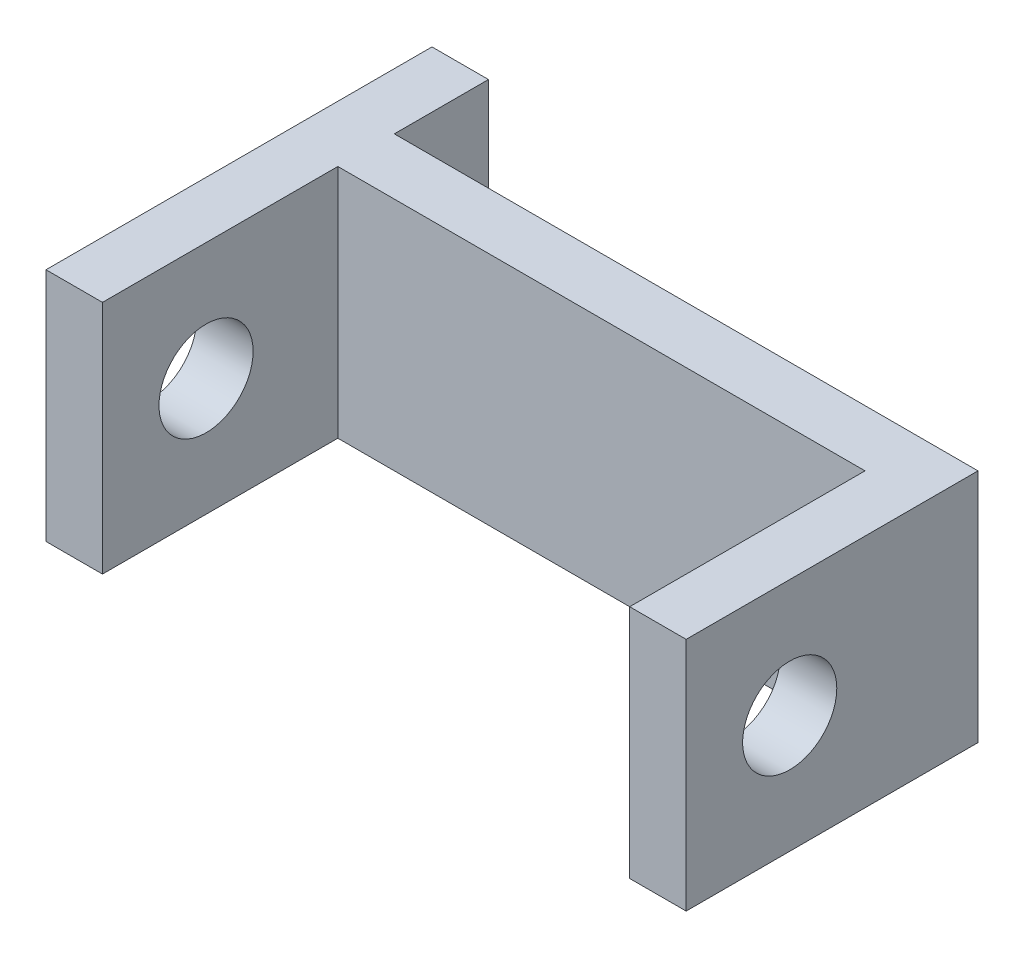
ISO-10303-21;
HEADER;
FILE_DESCRIPTION(('STEP AP214'),'2;1');
FILE_NAME('part.step','',(''),(''),'','','');
FILE_SCHEMA(('AUTOMOTIVE_DESIGN { 1 0 10303 214 1 1 1 1 }'));
ENDSEC;
DATA;
#1=APPLICATION_CONTEXT('core data for automotive mechanical design processes');
#2=APPLICATION_PROTOCOL_DEFINITION('international standard','automotive_design',2000,#1);
#3=PRODUCT_CONTEXT('',#1,'mechanical');
#4=PRODUCT('Part','Part','',(#3));
#5=PRODUCT_RELATED_PRODUCT_CATEGORY('part','',(#4));
#6=PRODUCT_DEFINITION_FORMATION('','',#4);
#7=PRODUCT_DEFINITION_CONTEXT('part definition',#1,'design');
#8=PRODUCT_DEFINITION('design','',#6,#7);
#9=PRODUCT_DEFINITION_SHAPE('','',#8);
#10=(LENGTH_UNIT() NAMED_UNIT(*) SI_UNIT(.MILLI.,.METRE.));
#11=(NAMED_UNIT(*) PLANE_ANGLE_UNIT() SI_UNIT($,.RADIAN.));
#12=(NAMED_UNIT(*) SI_UNIT($,.STERADIAN.) SOLID_ANGLE_UNIT());
#13=UNCERTAINTY_MEASURE_WITH_UNIT(LENGTH_MEASURE(1.E-05),#10,'distance_accuracy_value','');
#14=(GEOMETRIC_REPRESENTATION_CONTEXT(3) GLOBAL_UNCERTAINTY_ASSIGNED_CONTEXT((#13)) GLOBAL_UNIT_ASSIGNED_CONTEXT((#10,
#11,#12)) REPRESENTATION_CONTEXT('',''));
#15=CARTESIAN_POINT('',(0.,0.,0.));
#16=DIRECTION('',(0.,0.,1.));
#17=DIRECTION('',(1.,0.,0.));
#18=AXIS2_PLACEMENT_3D('',#15,#16,#17);
#19=CARTESIAN_POINT('',(0.,0.,0.));
#20=DIRECTION('',(0.,0.,1.));
#21=DIRECTION('',(1.,0.,0.));
#22=AXIS2_PLACEMENT_3D('',#19,#20,#21);
#23=PLANE('',#22);
#24=DIRECTION('',(0.,-1.,0.));
#25=VECTOR('',#24,1.);
#26=CARTESIAN_POINT('',(2.68799289100633,0.,0.));
#27=LINE('',#26,#25);
#28=CARTESIAN_POINT('',(2.68799289100633,5.,0.));
#29=VERTEX_POINT('',#28);
#30=CARTESIAN_POINT('',(2.68799289100633,0.,0.));
#31=VERTEX_POINT('',#30);
#32=EDGE_CURVE('E56',#29,#31,#27,.T.);
#33=ORIENTED_EDGE('',*,*,#32,.F.);
#34=DIRECTION('',(-1.,0.,0.));
#35=VECTOR('',#34,1.);
#36=CARTESIAN_POINT('',(15.0879928910063,5.,0.));
#37=LINE('',#36,#35);
#38=CARTESIAN_POINT('',(15.0879928910063,5.,0.));
#39=VERTEX_POINT('',#38);
#40=EDGE_CURVE('E226',#39,#29,#37,.T.);
#41=ORIENTED_EDGE('',*,*,#40,.F.);
#42=DIRECTION('',(0.,1.,0.));
#43=VECTOR('',#42,1.);
#44=CARTESIAN_POINT('',(15.0879928910063,0.,0.));
#45=LINE('',#44,#43);
#46=CARTESIAN_POINT('',(15.0879928910063,0.,0.));
#47=VERTEX_POINT('',#46);
#48=EDGE_CURVE('E231',#47,#39,#45,.T.);
#49=ORIENTED_EDGE('',*,*,#48,.F.);
#50=DIRECTION('',(1.,0.,0.));
#51=VECTOR('',#50,1.);
#52=CARTESIAN_POINT('',(1.48799289100633,0.,0.));
#53=LINE('',#52,#51);
#54=EDGE_CURVE('E219',#31,#47,#53,.T.);
#55=ORIENTED_EDGE('',*,*,#54,.F.);
#56=EDGE_LOOP('',(#33,#41,#49,#55));
#57=FACE_BOUND('',#56,.T.);
#58=ADVANCED_FACE('F39',(#57),#23,.F.);
#59=CARTESIAN_POINT('',(0.,0.,1.2));
#60=DIRECTION('',(0.,0.,1.));
#61=DIRECTION('',(1.,0.,0.));
#62=AXIS2_PLACEMENT_3D('',#59,#60,#61);
#63=PLANE('',#62);
#64=DIRECTION('',(0.,-1.,0.));
#65=VECTOR('',#64,1.);
#66=CARTESIAN_POINT('',(2.68799289100633,5.,1.2));
#67=LINE('',#66,#65);
#68=CARTESIAN_POINT('',(2.68799289100633,5.,1.2));
#69=VERTEX_POINT('',#68);
#70=CARTESIAN_POINT('',(2.68799289100633,0.,1.2));
#71=VERTEX_POINT('',#70);
#72=EDGE_CURVE('E64',#69,#71,#67,.T.);
#73=ORIENTED_EDGE('',*,*,#72,.T.);
#74=DIRECTION('',(1.,0.,0.));
#75=VECTOR('',#74,1.);
#76=CARTESIAN_POINT('',(1.48799289100633,0.,1.2));
#77=LINE('',#76,#75);
#78=CARTESIAN_POINT('',(13.8879928910063,0.,1.2));
#79=VERTEX_POINT('',#78);
#80=EDGE_CURVE('E223',#71,#79,#77,.T.);
#81=ORIENTED_EDGE('',*,*,#80,.T.);
#82=DIRECTION('',(0.,1.,0.));
#83=VECTOR('',#82,1.);
#84=CARTESIAN_POINT('',(13.8879928910063,0.,1.2));
#85=LINE('',#84,#83);
#86=CARTESIAN_POINT('',(13.8879928910063,5.,1.2));
#87=VERTEX_POINT('',#86);
#88=EDGE_CURVE('E192',#79,#87,#85,.T.);
#89=ORIENTED_EDGE('',*,*,#88,.T.);
#90=DIRECTION('',(-1.,0.,0.));
#91=VECTOR('',#90,1.);
#92=CARTESIAN_POINT('',(15.0879928910063,5.,1.2));
#93=LINE('',#92,#91);
#94=EDGE_CURVE('E129',#87,#69,#93,.T.);
#95=ORIENTED_EDGE('',*,*,#94,.T.);
#96=EDGE_LOOP('',(#73,#81,#89,#95));
#97=FACE_BOUND('',#96,.T.);
#98=ADVANCED_FACE('F259',(#97),#63,.T.);
#99=CARTESIAN_POINT('',(1.48799289100633,5.,1.2));
#100=DIRECTION('',(1.,0.,0.));
#101=DIRECTION('',(0.,0.,-1.));
#102=AXIS2_PLACEMENT_3D('',#99,#100,#101);
#103=PLANE('',#102);
#104=CARTESIAN_POINT('',(1.48799289100633,2.5,4.));
#105=DIRECTION('',(1.,0.,0.));
#106=DIRECTION('',(0.,0.,-1.));
#107=AXIS2_PLACEMENT_3D('',#104,#105,#106);
#108=CIRCLE('',#107,1.);
#109=CARTESIAN_POINT('',(1.48799289100633,2.5,3.));
#110=VERTEX_POINT('',#109);
#111=EDGE_CURVE('E168',#110,#110,#108,.T.);
#112=ORIENTED_EDGE('',*,*,#111,.T.);
#113=EDGE_LOOP('',(#112));
#114=FACE_BOUND('',#113,.T.);
#115=DIRECTION('',(0.,0.,-1.));
#116=VECTOR('',#115,1.);
#117=CARTESIAN_POINT('',(1.48799289100633,5.,1.2));
#118=LINE('',#117,#116);
#119=CARTESIAN_POINT('',(1.48799289100633,5.,6.2));
#120=VERTEX_POINT('',#119);
#121=CARTESIAN_POINT('',(1.48799289100633,5.,-2.));
#122=VERTEX_POINT('',#121);
#123=EDGE_CURVE('E118',#120,#122,#118,.T.);
#124=ORIENTED_EDGE('',*,*,#123,.T.);
#125=DIRECTION('',(0.,1.,0.));
#126=VECTOR('',#125,1.);
#127=CARTESIAN_POINT('',(1.48799289100633,0.,-2.));
#128=LINE('',#127,#126);
#129=CARTESIAN_POINT('',(1.48799289100633,0.,-2.));
#130=VERTEX_POINT('',#129);
#131=EDGE_CURVE('E121',#130,#122,#128,.T.);
#132=ORIENTED_EDGE('',*,*,#131,.F.);
#133=DIRECTION('',(0.,0.,-1.));
#134=VECTOR('',#133,1.);
#135=CARTESIAN_POINT('',(1.48799289100633,0.,1.2));
#136=LINE('',#135,#134);
#137=CARTESIAN_POINT('',(1.48799289100633,0.,6.2));
#138=VERTEX_POINT('',#137);
#139=EDGE_CURVE('E11',#138,#130,#136,.T.);
#140=ORIENTED_EDGE('',*,*,#139,.F.);
#141=DIRECTION('',(0.,1.,0.));
#142=VECTOR('',#141,1.);
#143=CARTESIAN_POINT('',(1.48799289100633,5.,6.2));
#144=LINE('',#143,#142);
#145=EDGE_CURVE('E123',#138,#120,#144,.T.);
#146=ORIENTED_EDGE('',*,*,#145,.T.);
#147=EDGE_LOOP('',(#124,#132,#140,#146));
#148=FACE_BOUND('',#147,.T.);
#149=ADVANCED_FACE('F41',(#114,#148),#103,.F.);
#150=CARTESIAN_POINT('',(1.48799289100633,0.,1.2));
#151=DIRECTION('',(0.,1.,0.));
#152=DIRECTION('',(0.,0.,1.));
#153=AXIS2_PLACEMENT_3D('',#150,#151,#152);
#154=PLANE('',#153);
#155=ORIENTED_EDGE('',*,*,#139,.T.);
#156=DIRECTION('',(-1.,0.,0.));
#157=VECTOR('',#156,1.);
#158=CARTESIAN_POINT('',(1.48799289100633,0.,-2.));
#159=LINE('',#158,#157);
#160=CARTESIAN_POINT('',(2.68799289100633,0.,-2.));
#161=VERTEX_POINT('',#160);
#162=EDGE_CURVE('E144',#161,#130,#159,.T.);
#163=ORIENTED_EDGE('',*,*,#162,.F.);
#164=DIRECTION('',(0.,0.,1.));
#165=VECTOR('',#164,1.);
#166=CARTESIAN_POINT('',(2.68799289100633,0.,-2.));
#167=LINE('',#166,#165);
#168=EDGE_CURVE('E153',#161,#31,#167,.T.);
#169=ORIENTED_EDGE('',*,*,#168,.T.);
#170=ORIENTED_EDGE('',*,*,#54,.T.);
#171=DIRECTION('',(0.,0.,-1.));
#172=VECTOR('',#171,1.);
#173=CARTESIAN_POINT('',(15.0879928910063,0.,1.2));
#174=LINE('',#173,#172);
#175=CARTESIAN_POINT('',(15.0879928910063,0.,6.2));
#176=VERTEX_POINT('',#175);
#177=EDGE_CURVE('E49',#176,#47,#174,.T.);
#178=ORIENTED_EDGE('',*,*,#177,.F.);
#179=DIRECTION('',(-1.,0.,0.));
#180=VECTOR('',#179,1.);
#181=CARTESIAN_POINT('',(15.0879928910063,0.,6.2));
#182=LINE('',#181,#180);
#183=CARTESIAN_POINT('',(13.8879928910063,0.,6.2));
#184=VERTEX_POINT('',#183);
#185=EDGE_CURVE('E200',#176,#184,#182,.T.);
#186=ORIENTED_EDGE('',*,*,#185,.T.);
#187=DIRECTION('',(0.,0.,-1.));
#188=VECTOR('',#187,1.);
#189=CARTESIAN_POINT('',(13.8879928910063,0.,6.2));
#190=LINE('',#189,#188);
#191=EDGE_CURVE('E212',#184,#79,#190,.T.);
#192=ORIENTED_EDGE('',*,*,#191,.T.);
#193=ORIENTED_EDGE('',*,*,#80,.F.);
#194=DIRECTION('',(0.,0.,-1.));
#195=VECTOR('',#194,1.);
#196=CARTESIAN_POINT('',(2.68799289100633,0.,6.2));
#197=LINE('',#196,#195);
#198=CARTESIAN_POINT('',(2.68799289100633,0.,6.2));
#199=VERTEX_POINT('',#198);
#200=EDGE_CURVE('E188',#199,#71,#197,.T.);
#201=ORIENTED_EDGE('',*,*,#200,.F.);
#202=DIRECTION('',(-1.,0.,0.));
#203=VECTOR('',#202,1.);
#204=CARTESIAN_POINT('',(1.48799289100633,0.,6.2));
#205=LINE('',#204,#203);
#206=EDGE_CURVE('E181',#199,#138,#205,.T.);
#207=ORIENTED_EDGE('',*,*,#206,.T.);
#208=EDGE_LOOP('',(#155,#163,#169,#170,#178,#186,#192,#193,#201,#207));
#209=FACE_BOUND('',#208,.T.);
#210=ADVANCED_FACE('F250',(#209),#154,.F.);
#211=CARTESIAN_POINT('',(15.0879928910063,0.,1.2));
#212=DIRECTION('',(-1.,0.,0.));
#213=DIRECTION('',(0.,0.,1.));
#214=AXIS2_PLACEMENT_3D('',#211,#212,#213);
#215=PLANE('',#214);
#216=CARTESIAN_POINT('',(15.0879928910063,2.5,4.));
#217=DIRECTION('',(1.,0.,0.));
#218=DIRECTION('',(0.,0.,-1.));
#219=AXIS2_PLACEMENT_3D('',#216,#217,#218);
#220=CIRCLE('',#219,1.);
#221=CARTESIAN_POINT('',(15.0879928910063,2.5,3.));
#222=VERTEX_POINT('',#221);
#223=EDGE_CURVE('E160',#222,#222,#220,.T.);
#224=ORIENTED_EDGE('',*,*,#223,.F.);
#225=EDGE_LOOP('',(#224));
#226=FACE_BOUND('',#225,.T.);
#227=ORIENTED_EDGE('',*,*,#48,.T.);
#228=DIRECTION('',(0.,0.,-1.));
#229=VECTOR('',#228,1.);
#230=CARTESIAN_POINT('',(15.0879928910063,5.,1.2));
#231=LINE('',#230,#229);
#232=CARTESIAN_POINT('',(15.0879928910063,5.,6.2));
#233=VERTEX_POINT('',#232);
#234=EDGE_CURVE('E128',#233,#39,#231,.T.);
#235=ORIENTED_EDGE('',*,*,#234,.F.);
#236=DIRECTION('',(0.,-1.,0.));
#237=VECTOR('',#236,1.);
#238=CARTESIAN_POINT('',(15.0879928910063,0.,6.2));
#239=LINE('',#238,#237);
#240=EDGE_CURVE('E196',#233,#176,#239,.T.);
#241=ORIENTED_EDGE('',*,*,#240,.T.);
#242=ORIENTED_EDGE('',*,*,#177,.T.);
#243=EDGE_LOOP('',(#227,#235,#241,#242));
#244=FACE_BOUND('',#243,.T.);
#245=ADVANCED_FACE('F243',(#226,#244),#215,.F.);
#246=CARTESIAN_POINT('',(15.0879928910063,5.,1.2));
#247=DIRECTION('',(0.,-1.,0.));
#248=DIRECTION('',(1.,0.,0.));
#249=AXIS2_PLACEMENT_3D('',#246,#247,#248);
#250=PLANE('',#249);
#251=ORIENTED_EDGE('',*,*,#40,.T.);
#252=DIRECTION('',(0.,0.,1.));
#253=VECTOR('',#252,1.);
#254=CARTESIAN_POINT('',(2.68799289100633,5.,-2.));
#255=LINE('',#254,#253);
#256=CARTESIAN_POINT('',(2.68799289100633,5.,-2.));
#257=VERTEX_POINT('',#256);
#258=EDGE_CURVE('E135',#257,#29,#255,.T.);
#259=ORIENTED_EDGE('',*,*,#258,.F.);
#260=DIRECTION('',(1.,0.,0.));
#261=VECTOR('',#260,1.);
#262=CARTESIAN_POINT('',(1.48799289100633,5.,-2.));
#263=LINE('',#262,#261);
#264=EDGE_CURVE('E132',#122,#257,#263,.T.);
#265=ORIENTED_EDGE('',*,*,#264,.F.);
#266=ORIENTED_EDGE('',*,*,#123,.F.);
#267=DIRECTION('',(1.,0.,0.));
#268=VECTOR('',#267,1.);
#269=CARTESIAN_POINT('',(1.48799289100633,5.,6.2));
#270=LINE('',#269,#268);
#271=CARTESIAN_POINT('',(2.68799289100633,5.,6.2));
#272=VERTEX_POINT('',#271);
#273=EDGE_CURVE('E174',#120,#272,#270,.T.);
#274=ORIENTED_EDGE('',*,*,#273,.T.);
#275=DIRECTION('',(0.,0.,-1.));
#276=VECTOR('',#275,1.);
#277=CARTESIAN_POINT('',(2.68799289100633,5.,6.2));
#278=LINE('',#277,#276);
#279=EDGE_CURVE('E185',#272,#69,#278,.T.);
#280=ORIENTED_EDGE('',*,*,#279,.T.);
#281=ORIENTED_EDGE('',*,*,#94,.F.);
#282=DIRECTION('',(0.,0.,-1.));
#283=VECTOR('',#282,1.);
#284=CARTESIAN_POINT('',(13.8879928910063,5.,6.2));
#285=LINE('',#284,#283);
#286=CARTESIAN_POINT('',(13.8879928910063,5.,6.2));
#287=VERTEX_POINT('',#286);
#288=EDGE_CURVE('E216',#287,#87,#285,.T.);
#289=ORIENTED_EDGE('',*,*,#288,.F.);
#290=DIRECTION('',(1.,0.,0.));
#291=VECTOR('',#290,1.);
#292=CARTESIAN_POINT('',(15.0879928910063,5.,6.2));
#293=LINE('',#292,#291);
#294=EDGE_CURVE('E208',#287,#233,#293,.T.);
#295=ORIENTED_EDGE('',*,*,#294,.T.);
#296=ORIENTED_EDGE('',*,*,#234,.T.);
#297=EDGE_LOOP('',(#251,#259,#265,#266,#274,#280,#281,#289,#295,#296));
#298=FACE_BOUND('',#297,.T.);
#299=ADVANCED_FACE('F133',(#298),#250,.F.);
#300=CARTESIAN_POINT('',(13.8879928910063,0.,6.2));
#301=DIRECTION('',(-1.,0.,0.));
#302=DIRECTION('',(0.,0.,1.));
#303=AXIS2_PLACEMENT_3D('',#300,#301,#302);
#304=PLANE('',#303);
#305=CARTESIAN_POINT('',(13.8879928910063,2.5,4.));
#306=DIRECTION('',(-1.,0.,0.));
#307=DIRECTION('',(0.,0.,1.));
#308=AXIS2_PLACEMENT_3D('',#305,#306,#307);
#309=CIRCLE('',#308,1.);
#310=CARTESIAN_POINT('',(13.8879928910063,2.5,5.));
#311=VERTEX_POINT('',#310);
#312=EDGE_CURVE('E164',#311,#311,#309,.T.);
#313=ORIENTED_EDGE('',*,*,#312,.F.);
#314=EDGE_LOOP('',(#313));
#315=FACE_BOUND('',#314,.T.);
#316=ORIENTED_EDGE('',*,*,#88,.F.);
#317=ORIENTED_EDGE('',*,*,#191,.F.);
#318=DIRECTION('',(0.,1.,0.));
#319=VECTOR('',#318,1.);
#320=CARTESIAN_POINT('',(13.8879928910063,0.,6.2));
#321=LINE('',#320,#319);
#322=EDGE_CURVE('E204',#184,#287,#321,.T.);
#323=ORIENTED_EDGE('',*,*,#322,.T.);
#324=ORIENTED_EDGE('',*,*,#288,.T.);
#325=EDGE_LOOP('',(#316,#317,#323,#324));
#326=FACE_BOUND('',#325,.T.);
#327=ADVANCED_FACE('F261',(#315,#326),#304,.T.);
#328=CARTESIAN_POINT('',(0.,0.,6.2));
#329=DIRECTION('',(0.,0.,1.));
#330=DIRECTION('',(1.,0.,0.));
#331=AXIS2_PLACEMENT_3D('',#328,#329,#330);
#332=PLANE('',#331);
#333=ORIENTED_EDGE('',*,*,#240,.F.);
#334=ORIENTED_EDGE('',*,*,#294,.F.);
#335=ORIENTED_EDGE('',*,*,#322,.F.);
#336=ORIENTED_EDGE('',*,*,#185,.F.);
#337=EDGE_LOOP('',(#333,#334,#335,#336));
#338=FACE_BOUND('',#337,.T.);
#339=ADVANCED_FACE('F265',(#338),#332,.T.);
#340=CARTESIAN_POINT('',(2.68799289100633,5.,6.2));
#341=DIRECTION('',(1.,0.,0.));
#342=DIRECTION('',(0.,1.,0.));
#343=AXIS2_PLACEMENT_3D('',#340,#341,#342);
#344=PLANE('',#343);
#345=CARTESIAN_POINT('',(2.68799289100633,2.5,4.));
#346=DIRECTION('',(1.,0.,0.));
#347=DIRECTION('',(0.,1.,0.));
#348=AXIS2_PLACEMENT_3D('',#345,#346,#347);
#349=CIRCLE('',#348,1.);
#350=CARTESIAN_POINT('',(2.68799289100633,3.5,4.));
#351=VERTEX_POINT('',#350);
#352=EDGE_CURVE('E43',#351,#351,#349,.T.);
#353=ORIENTED_EDGE('',*,*,#352,.F.);
#354=EDGE_LOOP('',(#353));
#355=FACE_BOUND('',#354,.T.);
#356=ORIENTED_EDGE('',*,*,#72,.F.);
#357=ORIENTED_EDGE('',*,*,#279,.F.);
#358=DIRECTION('',(0.,-1.,0.));
#359=VECTOR('',#358,1.);
#360=CARTESIAN_POINT('',(2.68799289100633,5.,6.2));
#361=LINE('',#360,#359);
#362=EDGE_CURVE('E177',#272,#199,#361,.T.);
#363=ORIENTED_EDGE('',*,*,#362,.T.);
#364=ORIENTED_EDGE('',*,*,#200,.T.);
#365=EDGE_LOOP('',(#356,#357,#363,#364));
#366=FACE_BOUND('',#365,.T.);
#367=ADVANCED_FACE('F257',(#355,#366),#344,.T.);
#368=CARTESIAN_POINT('',(0.,0.,6.2));
#369=DIRECTION('',(0.,0.,1.));
#370=DIRECTION('',(1.,0.,0.));
#371=AXIS2_PLACEMENT_3D('',#368,#369,#370);
#372=PLANE('',#371);
#373=ORIENTED_EDGE('',*,*,#145,.F.);
#374=ORIENTED_EDGE('',*,*,#206,.F.);
#375=ORIENTED_EDGE('',*,*,#362,.F.);
#376=ORIENTED_EDGE('',*,*,#273,.F.);
#377=EDGE_LOOP('',(#373,#374,#375,#376));
#378=FACE_BOUND('',#377,.T.);
#379=ADVANCED_FACE('F253',(#378),#372,.T.);
#380=CARTESIAN_POINT('',(1.08799289100633,2.5,4.));
#381=DIRECTION('',(1.,0.,0.));
#382=DIRECTION('',(0.,0.,-1.));
#383=AXIS2_PLACEMENT_3D('',#380,#381,#382);
#384=CYLINDRICAL_SURFACE('',#383,1.);
#385=ORIENTED_EDGE('',*,*,#352,.T.);
#386=EDGE_LOOP('',(#385));
#387=FACE_BOUND('',#386,.T.);
#388=ORIENTED_EDGE('',*,*,#111,.F.);
#389=EDGE_LOOP('',(#388));
#390=FACE_BOUND('',#389,.T.);
#391=ADVANCED_FACE('F296',(#387,#390),#384,.F.);
#392=ORIENTED_EDGE('',*,*,#312,.T.);
#393=EDGE_LOOP('',(#392));
#394=FACE_BOUND('',#393,.T.);
#395=ORIENTED_EDGE('',*,*,#223,.T.);
#396=EDGE_LOOP('',(#395));
#397=FACE_BOUND('',#396,.T.);
#398=ADVANCED_FACE('F298',(#394,#397),#384,.F.);
#399=CARTESIAN_POINT('',(2.68799289100633,0.,-2.));
#400=DIRECTION('',(-1.,0.,0.));
#401=DIRECTION('',(0.,0.,1.));
#402=AXIS2_PLACEMENT_3D('',#399,#400,#401);
#403=PLANE('',#402);
#404=ORIENTED_EDGE('',*,*,#32,.T.);
#405=ORIENTED_EDGE('',*,*,#168,.F.);
#406=DIRECTION('',(0.,-1.,0.));
#407=VECTOR('',#406,1.);
#408=CARTESIAN_POINT('',(2.68799289100633,0.,-2.));
#409=LINE('',#408,#407);
#410=EDGE_CURVE('E139',#257,#161,#409,.T.);
#411=ORIENTED_EDGE('',*,*,#410,.F.);
#412=ORIENTED_EDGE('',*,*,#258,.T.);
#413=EDGE_LOOP('',(#404,#405,#411,#412));
#414=FACE_BOUND('',#413,.T.);
#415=ADVANCED_FACE('F248',(#414),#403,.F.);
#416=CARTESIAN_POINT('',(0.,0.,-2.));
#417=DIRECTION('',(0.,0.,-1.));
#418=DIRECTION('',(-1.,0.,0.));
#419=AXIS2_PLACEMENT_3D('',#416,#417,#418);
#420=PLANE('',#419);
#421=ORIENTED_EDGE('',*,*,#131,.T.);
#422=ORIENTED_EDGE('',*,*,#264,.T.);
#423=ORIENTED_EDGE('',*,*,#410,.T.);
#424=ORIENTED_EDGE('',*,*,#162,.T.);
#425=EDGE_LOOP('',(#421,#422,#423,#424));
#426=FACE_BOUND('',#425,.T.);
#427=ADVANCED_FACE('F142',(#426),#420,.T.);
#428=CLOSED_SHELL('',(#58,#98,#149,#210,#245,#299,#327,#339,#367,#379,#391,#398,#415,#427));
#429=MANIFOLD_SOLID_BREP('B2',#428);
#430=ADVANCED_BREP_SHAPE_REPRESENTATION('',(#18,#429),#14);
#431=SHAPE_DEFINITION_REPRESENTATION(#9,#430);
ENDSEC;
END-ISO-10303-21;
